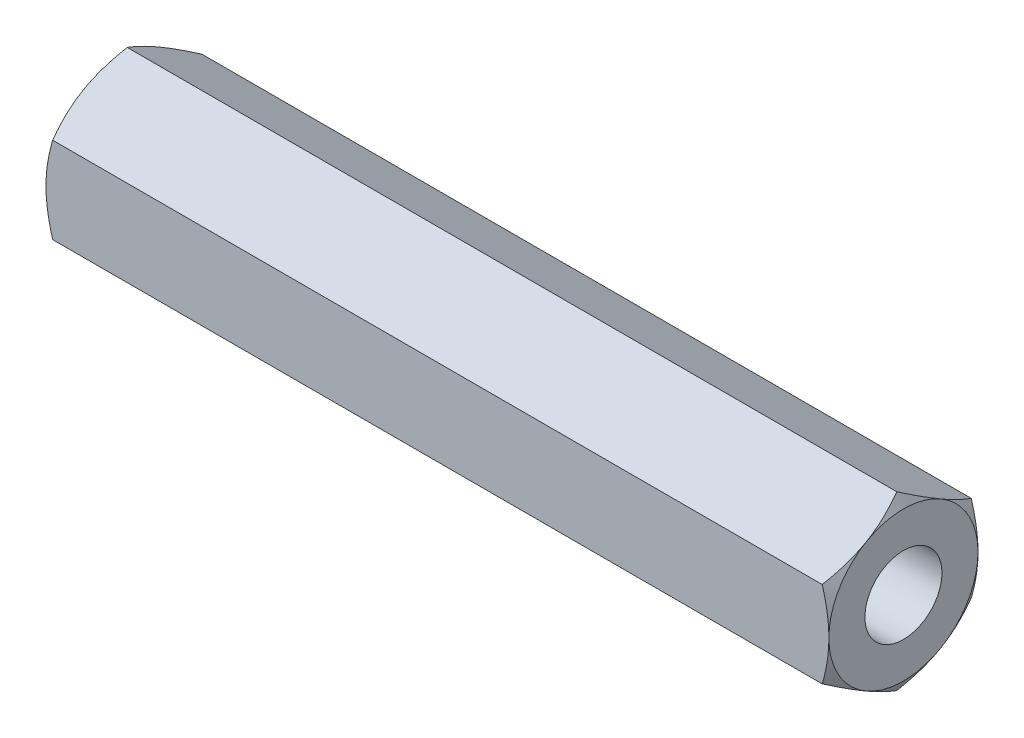
ISO-10303-21;
HEADER;
FILE_DESCRIPTION(('STEP AP214'),'2;1');
FILE_NAME('part.step','',(''),(''),'','','');
FILE_SCHEMA(('AUTOMOTIVE_DESIGN { 1 0 10303 214 1 1 1 1 }'));
ENDSEC;
DATA;
#1=APPLICATION_CONTEXT('core data for automotive mechanical design processes');
#2=APPLICATION_PROTOCOL_DEFINITION('international standard','automotive_design',2000,#1);
#3=PRODUCT_CONTEXT('',#1,'mechanical');
#4=PRODUCT('Part','Part','',(#3));
#5=PRODUCT_RELATED_PRODUCT_CATEGORY('part','',(#4));
#6=PRODUCT_DEFINITION_FORMATION('','',#4);
#7=PRODUCT_DEFINITION_CONTEXT('part definition',#1,'design');
#8=PRODUCT_DEFINITION('design','',#6,#7);
#9=PRODUCT_DEFINITION_SHAPE('','',#8);
#10=(LENGTH_UNIT() NAMED_UNIT(*) SI_UNIT(.MILLI.,.METRE.));
#11=(NAMED_UNIT(*) PLANE_ANGLE_UNIT() SI_UNIT($,.RADIAN.));
#12=(NAMED_UNIT(*) SI_UNIT($,.STERADIAN.) SOLID_ANGLE_UNIT());
#13=UNCERTAINTY_MEASURE_WITH_UNIT(LENGTH_MEASURE(1.E-05),#10,'distance_accuracy_value','');
#14=(GEOMETRIC_REPRESENTATION_CONTEXT(3) GLOBAL_UNCERTAINTY_ASSIGNED_CONTEXT((#13)) GLOBAL_UNIT_ASSIGNED_CONTEXT((#10,
#11,#12)) REPRESENTATION_CONTEXT('',''));
#15=CARTESIAN_POINT('',(0.,0.,0.));
#16=DIRECTION('',(0.,0.,1.));
#17=DIRECTION('',(1.,0.,0.));
#18=AXIS2_PLACEMENT_3D('',#15,#16,#17);
#19=CARTESIAN_POINT('',(42.,-2.3094010767585,4.));
#20=DIRECTION('',(0.,0.866025403784439,-0.5));
#21=DIRECTION('',(0.,0.5,0.866025403784439));
#22=AXIS2_PLACEMENT_3D('',#19,#20,#21);
#23=PLANE('',#22);
#24=CARTESIAN_POINT('',(41.6426677409252,-2.30928560670466,4.0002));
#25=CARTESIAN_POINT('',(41.7012821263517,-2.4107717464617,3.82442084967677));
#26=CARTESIAN_POINT('',(41.7545896785377,-2.51313390883499,3.64712438367362));
#27=CARTESIAN_POINT('',(41.8476383292536,-2.71963072479811,3.28946140682429));
#28=CARTESIAN_POINT('',(41.8873465109703,-2.82376904741904,3.10908854102985));
#29=CARTESIAN_POINT('',(41.9491577847197,-3.03075510011795,2.75057818129721));
#30=CARTESIAN_POINT('',(41.9716722684771,-3.13357098372492,2.57249584706486));
#31=CARTESIAN_POINT('',(41.9985493768534,-3.33968651028528,2.21549328283349));
#32=CARTESIAN_POINT('',(42.0029342585731,-3.44298540411434,2.0365743503559));
#33=CARTESIAN_POINT('',(41.99380992706,-3.63600352522932,1.70225715780327));
#34=CARTESIAN_POINT('',(41.982541046012,-3.72575165335065,1.54680884001293));
#35=CARTESIAN_POINT('',(41.9468260092018,-3.90466320392054,1.23692494436494));
#36=CARTESIAN_POINT('',(41.9223676542885,-3.99382600759478,1.08249043825587));
#37=CARTESIAN_POINT('',(41.8612239350807,-4.17310641015197,0.771967672225421));
#38=CARTESIAN_POINT('',(41.8242793963451,-4.26320131938131,0.615918711936898));
#39=CARTESIAN_POINT('',(41.740429927452,-4.4420474282755,0.306148164596161));
#40=CARTESIAN_POINT('',(41.6935446977873,-4.53080091904966,0.152422609226222));
#41=CARTESIAN_POINT('',(41.6426677409252,-4.61891762357084,-0.000199999999999203));
#42=B_SPLINE_CURVE_WITH_KNOTS('',3,(#24,#25,#26,#27,#28,#29,#30,#31,#32,#33,#34,#35,#36,#37,#38,
#39,#40,#41),.UNSPECIFIED.,.F.,.F.,(4,2,2,2,2,2,2,2,4),(0.,0.634047835695967,1.26961969224544,
1.88946157213122,2.50854226669297,3.04757825393386,3.58711366126904,4.13861653143764,
4.68903648037743),.UNSPECIFIED.);
#43=CARTESIAN_POINT('',(41.6427344100918,-2.3094010767585,4.));
#44=VERTEX_POINT('',#43);
#45=CARTESIAN_POINT('',(42.,-3.46410161513776,2.));
#46=VERTEX_POINT('',#45);
#47=EDGE_CURVE('E272',#44,#46,#42,.T.);
#48=ORIENTED_EDGE('',*,*,#47,.F.);
#49=DIRECTION('',(-1.,0.,0.));
#50=VECTOR('',#49,1.);
#51=CARTESIAN_POINT('',(42.,-2.3094010767585,4.));
#52=LINE('',#51,#50);
#53=CARTESIAN_POINT('',(0.357265589908165,-2.30940107675851,4.));
#54=VERTEX_POINT('',#53);
#55=EDGE_CURVE('E337',#44,#54,#52,.T.);
#56=ORIENTED_EDGE('',*,*,#55,.T.);
#57=CARTESIAN_POINT('',(0.357332259074767,-4.61891762357084,-0.000199999999999105));
#58=CARTESIAN_POINT('',(0.298717873648282,-4.5174314838138,0.175579150323229));
#59=CARTESIAN_POINT('',(0.245410321462262,-4.41506932144051,0.352875616326382));
#60=CARTESIAN_POINT('',(0.152361670746403,-4.20857250547739,0.710538593175708));
#61=CARTESIAN_POINT('',(0.112653489029703,-4.10443418285647,0.890911458970153));
#62=CARTESIAN_POINT('',(0.0508422152802779,-3.89744813015756,1.24942181870279));
#63=CARTESIAN_POINT('',(0.0283277315228877,-3.79463224655059,1.42750415293514));
#64=CARTESIAN_POINT('',(0.00145062314658058,-3.58851671999023,1.78450671716651));
#65=CARTESIAN_POINT('',(-0.0029342585730581,-3.48521782616117,1.9634256496441));
#66=CARTESIAN_POINT('',(0.00619007293996886,-3.29219970504619,2.29774284219673));
#67=CARTESIAN_POINT('',(0.0174589539879928,-3.20245157692486,2.45319115998707));
#68=CARTESIAN_POINT('',(0.053173990798192,-3.02354002635496,2.76307505563506));
#69=CARTESIAN_POINT('',(0.0776323457115323,-2.93437722268072,2.91750956174413));
#70=CARTESIAN_POINT('',(0.138776064919289,-2.75509682012354,3.22803232777458));
#71=CARTESIAN_POINT('',(0.175720603654863,-2.6650019108942,3.3840812880631));
#72=CARTESIAN_POINT('',(0.259570072548027,-2.486155802,3.69385183540384));
#73=CARTESIAN_POINT('',(0.30645530221274,-2.39740231122585,3.84757739077378));
#74=CARTESIAN_POINT('',(0.357332259074767,-2.30928560670466,4.0002));
#75=B_SPLINE_CURVE_WITH_KNOTS('',3,(#57,#58,#59,#60,#61,#62,#63,#64,#65,#66,#67,#68,#69,#70,#71,
#72,#73,#74),.UNSPECIFIED.,.F.,.F.,(4,2,2,2,2,2,2,2,4),(0.,0.634047835695967,1.26961969224544,
1.88946157213122,2.50854226669297,3.04757825393386,3.58711366126903,4.13861653143764,
4.68903648037743),.UNSPECIFIED.);
#76=CARTESIAN_POINT('',(0.,-3.46410161513776,2.));
#77=VERTEX_POINT('',#76);
#78=EDGE_CURVE('E220',#77,#54,#75,.T.);
#79=ORIENTED_EDGE('',*,*,#78,.F.);
#80=CARTESIAN_POINT('',(0.357265589908165,-4.61880215351701,0.));
#81=VERTEX_POINT('',#80);
#82=EDGE_CURVE('E335',#81,#77,#75,.T.);
#83=ORIENTED_EDGE('',*,*,#82,.F.);
#84=DIRECTION('',(-1.,0.,0.));
#85=VECTOR('',#84,1.);
#86=CARTESIAN_POINT('',(42.,-4.61880215351701,0.));
#87=LINE('',#86,#85);
#88=CARTESIAN_POINT('',(41.6427344100918,-4.61880215351701,0.));
#89=VERTEX_POINT('',#88);
#90=EDGE_CURVE('E298',#89,#81,#87,.T.);
#91=ORIENTED_EDGE('',*,*,#90,.F.);
#92=EDGE_CURVE('E267',#46,#89,#42,.T.);
#93=ORIENTED_EDGE('',*,*,#92,.F.);
#94=EDGE_LOOP('',(#48,#56,#79,#83,#91,#93));
#95=FACE_BOUND('',#94,.T.);
#96=ADVANCED_FACE('F41',(#95),#23,.F.);
#97=CARTESIAN_POINT('',(42.,-4.61880215351701,0.));
#98=DIRECTION('',(0.,0.866025403784439,0.5));
#99=DIRECTION('',(0.,-0.5,0.866025403784439));
#100=AXIS2_PLACEMENT_3D('',#97,#98,#99);
#101=PLANE('',#100);
#102=CARTESIAN_POINT('',(41.6426677409252,-4.61891762357084,0.00020000000000113));
#103=CARTESIAN_POINT('',(41.7012821263517,-4.5174314838138,-0.175579150323227));
#104=CARTESIAN_POINT('',(41.7545896785377,-4.41506932144052,-0.35287561632638));
#105=CARTESIAN_POINT('',(41.8476383292536,-4.20857250547739,-0.710538593175706));
#106=CARTESIAN_POINT('',(41.8873465109703,-4.10443418285647,-0.890911458970151));
#107=CARTESIAN_POINT('',(41.9491577847197,-3.89744813015756,-1.24942181870279));
#108=CARTESIAN_POINT('',(41.9716722684771,-3.79463224655059,-1.42750415293514));
#109=CARTESIAN_POINT('',(41.9985493768534,-3.58851671999023,-1.78450671716651));
#110=CARTESIAN_POINT('',(42.0029342585731,-3.48521782616117,-1.9634256496441));
#111=CARTESIAN_POINT('',(41.99380992706,-3.29219970504619,-2.29774284219673));
#112=CARTESIAN_POINT('',(41.982541046012,-3.20245157692486,-2.45319115998707));
#113=CARTESIAN_POINT('',(41.9468260092018,-3.02354002635497,-2.76307505563506));
#114=CARTESIAN_POINT('',(41.9223676542885,-2.93437722268072,-2.91750956174413));
#115=CARTESIAN_POINT('',(41.8612239350807,-2.75509682012354,-3.22803232777458));
#116=CARTESIAN_POINT('',(41.8242793963451,-2.6650019108942,-3.3840812880631));
#117=CARTESIAN_POINT('',(41.740429927452,-2.48615580200001,-3.69385183540384));
#118=CARTESIAN_POINT('',(41.6935446977873,-2.39740231122585,-3.84757739077378));
#119=CARTESIAN_POINT('',(41.6426677409252,-2.30928560670467,-4.0002));
#120=B_SPLINE_CURVE_WITH_KNOTS('',3,(#102,#103,#104,#105,#106,#107,#108,#109,#110,#111,#112,
#113,#114,#115,#116,#117,#118,#119),.UNSPECIFIED.,.F.,.F.,(4,2,2,2,2,2,2,2,4),(0.,
0.634047835695966,1.26961969224544,1.88946157213122,2.50854226669298,3.04757825393386,
3.58711366126903,4.13861653143764,4.68903648037743),.UNSPECIFIED.);
#121=CARTESIAN_POINT('',(42.,-3.46410161513776,-2.));
#122=VERTEX_POINT('',#121);
#123=EDGE_CURVE('E260',#89,#122,#120,.T.);
#124=ORIENTED_EDGE('',*,*,#123,.F.);
#125=ORIENTED_EDGE('',*,*,#90,.T.);
#126=CARTESIAN_POINT('',(0.357332259074767,-2.30928560670467,-4.0002));
#127=CARTESIAN_POINT('',(0.298717873648282,-2.41077174646171,-3.82442084967677));
#128=CARTESIAN_POINT('',(0.245410321462262,-2.513133908835,-3.64712438367362));
#129=CARTESIAN_POINT('',(0.152361670746403,-2.71963072479812,-3.28946140682429));
#130=CARTESIAN_POINT('',(0.112653489029703,-2.82376904741904,-3.10908854102985));
#131=CARTESIAN_POINT('',(0.0508422152802779,-3.03075510011795,-2.75057818129721));
#132=CARTESIAN_POINT('',(0.0283277315228874,-3.13357098372492,-2.57249584706485));
#133=CARTESIAN_POINT('',(0.00145062314658054,-3.33968651028528,-2.21549328283349));
#134=CARTESIAN_POINT('',(-0.00293425857305766,-3.44298540411434,-2.0365743503559));
#135=CARTESIAN_POINT('',(0.00619007293996941,-3.63600352522932,-1.70225715780326));
#136=CARTESIAN_POINT('',(0.0174589539879931,-3.72575165335065,-1.54680884001293));
#137=CARTESIAN_POINT('',(0.0531739907981921,-3.90466320392054,-1.23692494436494));
#138=CARTESIAN_POINT('',(0.0776323457115324,-3.99382600759478,-1.08249043825587));
#139=CARTESIAN_POINT('',(0.138776064919289,-4.17310641015197,-0.77196767222542));
#140=CARTESIAN_POINT('',(0.175720603654863,-4.26320131938131,-0.615918711936896));
#141=CARTESIAN_POINT('',(0.259570072548027,-4.4420474282755,-0.306148164596159));
#142=CARTESIAN_POINT('',(0.30645530221274,-4.53080091904966,-0.15242260922622));
#143=CARTESIAN_POINT('',(0.357332259074767,-4.61891762357084,0.000200000000000806));
#144=B_SPLINE_CURVE_WITH_KNOTS('',3,(#126,#127,#128,#129,#130,#131,#132,#133,#134,#135,#136,
#137,#138,#139,#140,#141,#142,#143),.UNSPECIFIED.,.F.,.F.,(4,2,2,2,2,2,2,2,4),(0.,
0.634047835695967,1.26961969224543,1.88946157213122,2.50854226669297,3.04757825393386,
3.58711366126903,4.13861653143764,4.68903648037743),.UNSPECIFIED.);
#145=CARTESIAN_POINT('',(0.,-3.46410161513776,-2.));
#146=VERTEX_POINT('',#145);
#147=EDGE_CURVE('E232',#146,#81,#144,.T.);
#148=ORIENTED_EDGE('',*,*,#147,.F.);
#149=CARTESIAN_POINT('',(0.357265589908165,-2.30940107675851,-4.));
#150=VERTEX_POINT('',#149);
#151=EDGE_CURVE('E238',#150,#146,#144,.T.);
#152=ORIENTED_EDGE('',*,*,#151,.F.);
#153=DIRECTION('',(-1.,0.,0.));
#154=VECTOR('',#153,1.);
#155=CARTESIAN_POINT('',(42.,-2.3094010767585,-4.));
#156=LINE('',#155,#154);
#157=CARTESIAN_POINT('',(41.6427344100918,-2.30940107675851,-4.));
#158=VERTEX_POINT('',#157);
#159=EDGE_CURVE('E292',#158,#150,#156,.T.);
#160=ORIENTED_EDGE('',*,*,#159,.F.);
#161=EDGE_CURVE('E254',#122,#158,#120,.T.);
#162=ORIENTED_EDGE('',*,*,#161,.F.);
#163=EDGE_LOOP('',(#124,#125,#148,#152,#160,#162));
#164=FACE_BOUND('',#163,.T.);
#165=ADVANCED_FACE('F246',(#164),#101,.F.);
#166=CARTESIAN_POINT('',(42.,-2.3094010767585,-4.));
#167=DIRECTION('',(0.,0.,1.));
#168=DIRECTION('',(1.,0.,0.));
#169=AXIS2_PLACEMENT_3D('',#166,#167,#168);
#170=PLANE('',#169);
#171=CARTESIAN_POINT('',(40.0858931787593,-6.12487198995892,-4.));
#172=CARTESIAN_POINT('',(40.1707637292331,-5.94924937038676,-4.));
#173=CARTESIAN_POINT('',(40.2547905961926,-5.77321152095286,-4.));
#174=CARTESIAN_POINT('',(40.4206748532028,-5.42008084777954,-4.));
#175=CARTESIAN_POINT('',(40.5025318676328,-5.24298784779927,-4.));
#176=CARTESIAN_POINT('',(40.6640255369414,-4.88656571686334,-4.));
#177=CARTESIAN_POINT('',(40.743646804937,-4.70722958889362,-4.));
#178=CARTESIAN_POINT('',(40.8994694145797,-4.34708334747263,-4.));
#179=CARTESIAN_POINT('',(40.975670934492,-4.16627331143537,-4.));
#180=CARTESIAN_POINT('',(41.1246493496056,-3.80064706744977,-4.));
#181=CARTESIAN_POINT('',(41.1973727157842,-3.6158089282277,-4.));
#182=CARTESIAN_POINT('',(41.3371237690406,-3.24395246794968,-4.));
#183=CARTESIAN_POINT('',(41.4041508224335,-3.05693390695801,-4.));
#184=CARTESIAN_POINT('',(41.5307082515691,-2.6808031825377,-4.));
#185=CARTESIAN_POINT('',(41.5902545652162,-2.49169643712848,-4.));
#186=CARTESIAN_POINT('',(41.6999166434555,-2.11079454635851,-4.));
#187=CARTESIAN_POINT('',(41.7500353903232,-1.91900027185749,-4.));
#188=CARTESIAN_POINT('',(41.838409205046,-1.532592326982,-4.));
#189=CARTESIAN_POINT('',(41.8766611140435,-1.33797792031649,-4.));
#190=CARTESIAN_POINT('',(41.9387257640777,-0.946402725872552,-4.));
#191=CARTESIAN_POINT('',(41.9625384923483,-0.749441936019772,-4.));
#192=CARTESIAN_POINT('',(41.9936181868506,-0.35545198962794,-4.));
#193=CARTESIAN_POINT('',(42.000989900761,-0.158431311094008,-4.));
#194=CARTESIAN_POINT('',(41.9987959336252,0.235472085607472,-4.));
#195=CARTESIAN_POINT('',(41.9892346491847,0.432354826312209,-4.));
#196=CARTESIAN_POINT('',(41.9591212653864,0.76856063522552,-4.));
#197=CARTESIAN_POINT('',(41.9424907039561,0.908254618381822,-4.));
#198=CARTESIAN_POINT('',(41.9017865896533,1.18656349063497,-4.));
#199=CARTESIAN_POINT('',(41.8777118629416,1.32517820601013,-4.));
#200=CARTESIAN_POINT('',(41.7955849290498,1.73929045452969,-4.));
#201=CARTESIAN_POINT('',(41.7276511135749,2.01284690528722,-4.));
#202=CARTESIAN_POINT('',(41.6104836406828,2.42218253014524,-4.));
#203=CARTESIAN_POINT('',(41.5682860581884,2.56009536361538,-4.));
#204=CARTESIAN_POINT('',(41.4797154197722,2.83448159101403,-4.));
#205=CARTESIAN_POINT('',(41.4333452438131,2.97095590623557,-4.));
#206=CARTESIAN_POINT('',(41.3373943008197,3.2418944051634,-4.));
#207=CARTESIAN_POINT('',(41.2878330742465,3.37636557946838,-4.));
#208=CARTESIAN_POINT('',(41.1858016462093,3.64426461152913,-4.));
#209=CARTESIAN_POINT('',(41.1333302690366,3.77769202239386,-4.));
#210=CARTESIAN_POINT('',(41.0796909934582,3.91063698986683,-4.));
#211=B_SPLINE_CURVE_WITH_KNOTS('',3,(#171,#172,#173,#174,#175,#176,#177,#178,#179,#180,#181,
#182,#183,#184,#185,#186,#187,#188,#189,#190,#191,#192,#193,#194,#195,#196,#197,#198,#199,#200,
#201,#202,#203,#204,#205,#206,#207,#208,#209,#210),.UNSPECIFIED.,.F.,.F.,(4,2,2,2,2,2,2,2,2,2,2,
2,2,2,2,2,2,2,2,4),(0.,0.585171792532272,1.17044423059927,1.7590659464599,2.34765694284827,
2.94347400997484,3.53935727210689,4.13394864697601,4.72835161391471,5.32291267067845,
5.91747425310813,6.50823685854037,7.09884609659887,7.52068140825521,7.9425832713084,
8.78701491359829,9.21965281897689,9.65199437116297,10.0819024146297,10.5119854255247),.UNSPECIFIED.);
#212=CARTESIAN_POINT('',(42.,0.,-4.));
#213=VERTEX_POINT('',#212);
#214=EDGE_CURVE('E261',#158,#213,#211,.T.);
#215=ORIENTED_EDGE('',*,*,#214,.F.);
#216=ORIENTED_EDGE('',*,*,#159,.T.);
#217=CARTESIAN_POINT('',(1.91410682124063,-6.12487198995892,-4.));
#218=CARTESIAN_POINT('',(1.82923627076689,-5.94924937038676,-4.));
#219=CARTESIAN_POINT('',(1.74520940380739,-5.77321152095286,-4.));
#220=CARTESIAN_POINT('',(1.57932514679716,-5.42008084777954,-4.));
#221=CARTESIAN_POINT('',(1.49746813236723,-5.24298784779927,-4.));
#222=CARTESIAN_POINT('',(1.33597446305855,-4.88656571686333,-4.));
#223=CARTESIAN_POINT('',(1.25635319506303,-4.70722958889362,-4.));
#224=CARTESIAN_POINT('',(1.10053058542029,-4.34708334747263,-4.));
#225=CARTESIAN_POINT('',(1.02432906550802,-4.16627331143537,-4.));
#226=CARTESIAN_POINT('',(0.875350650394359,-3.80064706744977,-4.));
#227=CARTESIAN_POINT('',(0.802627284215842,-3.61580892822769,-4.));
#228=CARTESIAN_POINT('',(0.662876230959417,-3.24395246794968,-4.));
#229=CARTESIAN_POINT('',(0.595849177566501,-3.05693390695801,-4.));
#230=CARTESIAN_POINT('',(0.469291748430878,-2.6808031825377,-4.));
#231=CARTESIAN_POINT('',(0.409745434783834,-2.49169643712848,-4.));
#232=CARTESIAN_POINT('',(0.300083356544504,-2.11079454635851,-4.));
#233=CARTESIAN_POINT('',(0.249964609676749,-1.91900027185748,-4.));
#234=CARTESIAN_POINT('',(0.16159079495404,-1.532592326982,-4.));
#235=CARTESIAN_POINT('',(0.123338885956538,-1.33797792031649,-4.));
#236=CARTESIAN_POINT('',(0.0612742359223416,-0.946402725872551,-4.));
#237=CARTESIAN_POINT('',(0.0374615076516972,-0.749441936019771,-4.));
#238=CARTESIAN_POINT('',(0.00638181314943468,-0.35545198962794,-4.));
#239=CARTESIAN_POINT('',(-0.000989900761042906,-0.158431311094009,-4.));
#240=CARTESIAN_POINT('',(0.00120406637479443,0.23547208560747,-4.));
#241=CARTESIAN_POINT('',(0.0107653508153499,0.432354826312207,-4.));
#242=CARTESIAN_POINT('',(0.0408787346135898,0.768560635225518,-4.));
#243=CARTESIAN_POINT('',(0.0575092960439087,0.908254618381821,-4.));
#244=CARTESIAN_POINT('',(0.0982134103466909,1.18656349063497,-4.));
#245=CARTESIAN_POINT('',(0.122288137058446,1.32517820601013,-4.));
#246=CARTESIAN_POINT('',(0.204415070950231,1.7392904545297,-4.));
#247=CARTESIAN_POINT('',(0.272348886425153,2.01284690528723,-4.));
#248=CARTESIAN_POINT('',(0.389516359317204,2.42218253014524,-4.));
#249=CARTESIAN_POINT('',(0.431713941811637,2.56009536361539,-4.));
#250=CARTESIAN_POINT('',(0.520284580227763,2.83448159101404,-4.));
#251=CARTESIAN_POINT('',(0.566654756186913,2.97095590623558,-4.));
#252=CARTESIAN_POINT('',(0.662605699180287,3.24189440516341,-4.));
#253=CARTESIAN_POINT('',(0.712166925753501,3.37636557946839,-4.));
#254=CARTESIAN_POINT('',(0.814198353790704,3.64426461152915,-4.));
#255=CARTESIAN_POINT('',(0.866669730963372,3.77769202239388,-4.));
#256=CARTESIAN_POINT('',(0.920309006541795,3.91063698986685,-4.));
#257=B_SPLINE_CURVE_WITH_KNOTS('',3,(#217,#218,#219,#220,#221,#222,#223,#224,#225,#226,#227,
#228,#229,#230,#231,#232,#233,#234,#235,#236,#237,#238,#239,#240,#241,#242,#243,#244,#245,#246,
#247,#248,#249,#250,#251,#252,#253,#254,#255,#256),.UNSPECIFIED.,.F.,.F.,(4,2,2,2,2,2,2,2,2,2,2,
2,2,2,2,2,2,2,2,4),(0.,0.58517179253227,1.17044423059927,1.7590659464599,2.34765694284827,
2.94347400997483,3.53935727210689,4.133948646976,4.72835161391471,5.32291267067845,
5.91747425310812,6.50823685854036,7.09884609659886,7.52068140825521,7.94258327130839,
8.7870149135983,9.21965281897689,9.65199437116297,10.0819024146297,10.5119854255247),.UNSPECIFIED.);
#258=CARTESIAN_POINT('',(0.,0.,-4.));
#259=VERTEX_POINT('',#258);
#260=EDGE_CURVE('E239',#259,#150,#257,.F.);
#261=ORIENTED_EDGE('',*,*,#260,.F.);
#262=CARTESIAN_POINT('',(0.357265589908165,2.3094010767585,-4.));
#263=VERTEX_POINT('',#262);
#264=EDGE_CURVE('E346',#263,#259,#257,.F.);
#265=ORIENTED_EDGE('',*,*,#264,.F.);
#266=DIRECTION('',(-1.,0.,0.));
#267=VECTOR('',#266,1.);
#268=CARTESIAN_POINT('',(42.,2.30940107675851,-4.));
#269=LINE('',#268,#267);
#270=CARTESIAN_POINT('',(41.6427344100918,2.30940107675851,-4.));
#271=VERTEX_POINT('',#270);
#272=EDGE_CURVE('E299',#271,#263,#269,.T.);
#273=ORIENTED_EDGE('',*,*,#272,.F.);
#274=EDGE_CURVE('E262',#213,#271,#211,.T.);
#275=ORIENTED_EDGE('',*,*,#274,.F.);
#276=EDGE_LOOP('',(#215,#216,#261,#265,#273,#275));
#277=FACE_BOUND('',#276,.T.);
#278=ADVANCED_FACE('F249',(#277),#170,.F.);
#279=CARTESIAN_POINT('',(42.,2.30940107675851,-4.));
#280=DIRECTION('',(0.,-0.866025403784438,0.5));
#281=DIRECTION('',(0.,-0.5,-0.866025403784439));
#282=AXIS2_PLACEMENT_3D('',#279,#280,#281);
#283=PLANE('',#282);
#284=CARTESIAN_POINT('',(41.6426677409252,2.30928560670467,-4.0002));
#285=CARTESIAN_POINT('',(41.7012821263517,2.41077174646171,-3.82442084967677));
#286=CARTESIAN_POINT('',(41.7545896785377,2.513133908835,-3.64712438367362));
#287=CARTESIAN_POINT('',(41.8476383292536,2.71963072479812,-3.28946140682429));
#288=CARTESIAN_POINT('',(41.8873465109703,2.82376904741905,-3.10908854102985));
#289=CARTESIAN_POINT('',(41.9491577847197,3.03075510011795,-2.75057818129721));
#290=CARTESIAN_POINT('',(41.9716722684771,3.13357098372492,-2.57249584706485));
#291=CARTESIAN_POINT('',(41.9985493768534,3.33968651028529,-2.21549328283349));
#292=CARTESIAN_POINT('',(42.0029342585731,3.44298540411434,-2.0365743503559));
#293=CARTESIAN_POINT('',(41.99380992706,3.63600352522933,-1.70225715780326));
#294=CARTESIAN_POINT('',(41.982541046012,3.72575165335065,-1.54680884001293));
#295=CARTESIAN_POINT('',(41.9468260092018,3.90466320392055,-1.23692494436494));
#296=CARTESIAN_POINT('',(41.9223676542885,3.99382600759479,-1.08249043825587));
#297=CARTESIAN_POINT('',(41.8612239350807,4.17310641015197,-0.771967672225422));
#298=CARTESIAN_POINT('',(41.8242793963451,4.26320131938131,-0.615918711936898));
#299=CARTESIAN_POINT('',(41.740429927452,4.4420474282755,-0.306148164596161));
#300=CARTESIAN_POINT('',(41.6935446977873,4.53080091904966,-0.152422609226221));
#301=CARTESIAN_POINT('',(41.6426677409252,4.61891762357085,0.00019999999999897));
#302=B_SPLINE_CURVE_WITH_KNOTS('',3,(#284,#285,#286,#287,#288,#289,#290,#291,#292,#293,#294,
#295,#296,#297,#298,#299,#300,#301),.UNSPECIFIED.,.F.,.F.,(4,2,2,2,2,2,2,2,4),(0.,
0.634047835695966,1.26961969224544,1.88946157213122,2.50854226669297,3.04757825393386,
3.58711366126903,4.13861653143764,4.68903648037743),.UNSPECIFIED.);
#303=CARTESIAN_POINT('',(42.,3.46410161513776,-2.));
#304=VERTEX_POINT('',#303);
#305=EDGE_CURVE('E360',#271,#304,#302,.T.);
#306=ORIENTED_EDGE('',*,*,#305,.F.);
#307=ORIENTED_EDGE('',*,*,#272,.T.);
#308=CARTESIAN_POINT('',(0.357332259074769,4.61891762357085,0.000199999999999029));
#309=CARTESIAN_POINT('',(0.298717873648285,4.51743148381381,-0.175579150323229));
#310=CARTESIAN_POINT('',(0.245410321462264,4.41506932144052,-0.352875616326382));
#311=CARTESIAN_POINT('',(0.152361670746404,4.2085725054774,-0.710538593175708));
#312=CARTESIAN_POINT('',(0.112653489029704,4.10443418285647,-0.890911458970153));
#313=CARTESIAN_POINT('',(0.0508422152802789,3.89744813015756,-1.24942181870279));
#314=CARTESIAN_POINT('',(0.0283277315228891,3.79463224655059,-1.42750415293515));
#315=CARTESIAN_POINT('',(0.00145062314658209,3.58851671999023,-1.78450671716651));
#316=CARTESIAN_POINT('',(-0.00293425857305701,3.48521782616117,-1.9634256496441));
#317=CARTESIAN_POINT('',(0.00619007293997012,3.29219970504619,-2.29774284219674));
#318=CARTESIAN_POINT('',(0.0174589539879945,3.20245157692486,-2.45319115998707));
#319=CARTESIAN_POINT('',(0.0531739907981938,3.02354002635497,-2.76307505563506));
#320=CARTESIAN_POINT('',(0.0776323457115336,2.93437722268073,-2.91750956174413));
#321=CARTESIAN_POINT('',(0.13877606491929,2.75509682012354,-3.22803232777458));
#322=CARTESIAN_POINT('',(0.175720603654864,2.6650019108942,-3.3840812880631));
#323=CARTESIAN_POINT('',(0.259570072548028,2.48615580200001,-3.69385183540384));
#324=CARTESIAN_POINT('',(0.306455302212741,2.39740231122585,-3.84757739077378));
#325=CARTESIAN_POINT('',(0.357332259074767,2.30928560670467,-4.0002));
#326=B_SPLINE_CURVE_WITH_KNOTS('',3,(#308,#309,#310,#311,#312,#313,#314,#315,#316,#317,#318,
#319,#320,#321,#322,#323,#324,#325),.UNSPECIFIED.,.F.,.F.,(4,2,2,2,2,2,2,2,4),(0.,
0.634047835695967,1.26961969224544,1.88946157213122,2.50854226669297,3.04757825393386,
3.58711366126903,4.13861653143764,4.68903648037743),.UNSPECIFIED.);
#327=CARTESIAN_POINT('',(0.,3.46410161513776,-2.));
#328=VERTEX_POINT('',#327);
#329=EDGE_CURVE('E343',#328,#263,#326,.T.);
#330=ORIENTED_EDGE('',*,*,#329,.F.);
#331=CARTESIAN_POINT('',(0.357265589908165,4.61880215351701,0.));
#332=VERTEX_POINT('',#331);
#333=EDGE_CURVE('E226',#332,#328,#326,.T.);
#334=ORIENTED_EDGE('',*,*,#333,.F.);
#335=DIRECTION('',(-1.,0.,0.));
#336=VECTOR('',#335,1.);
#337=CARTESIAN_POINT('',(42.,4.61880215351701,0.));
#338=LINE('',#337,#336);
#339=CARTESIAN_POINT('',(41.6427344100918,4.61880215351701,0.));
#340=VERTEX_POINT('',#339);
#341=EDGE_CURVE('E303',#340,#332,#338,.T.);
#342=ORIENTED_EDGE('',*,*,#341,.F.);
#343=EDGE_CURVE('E359',#304,#340,#302,.T.);
#344=ORIENTED_EDGE('',*,*,#343,.F.);
#345=EDGE_LOOP('',(#306,#307,#330,#334,#342,#344));
#346=FACE_BOUND('',#345,.T.);
#347=ADVANCED_FACE('F358',(#346),#283,.F.);
#348=CARTESIAN_POINT('',(42.,4.61880215351701,0.));
#349=DIRECTION('',(0.,-0.866025403784439,-0.5));
#350=DIRECTION('',(0.,0.5,-0.866025403784439));
#351=AXIS2_PLACEMENT_3D('',#348,#349,#350);
#352=PLANE('',#351);
#353=CARTESIAN_POINT('',(41.6426677409252,4.61891762357085,-0.000200000000000971));
#354=CARTESIAN_POINT('',(41.7012821263517,4.51743148381381,0.175579150323227));
#355=CARTESIAN_POINT('',(41.7545896785377,4.41506932144052,0.352875616326379));
#356=CARTESIAN_POINT('',(41.8476383292536,4.2085725054774,0.710538593175705));
#357=CARTESIAN_POINT('',(41.8873465109703,4.10443418285647,0.89091145897015));
#358=CARTESIAN_POINT('',(41.9491577847197,3.89744813015756,1.24942181870279));
#359=CARTESIAN_POINT('',(41.9716722684771,3.79463224655059,1.42750415293514));
#360=CARTESIAN_POINT('',(41.9985493768534,3.58851671999023,1.78450671716651));
#361=CARTESIAN_POINT('',(42.0029342585731,3.48521782616117,1.9634256496441));
#362=CARTESIAN_POINT('',(41.99380992706,3.29219970504619,2.29774284219673));
#363=CARTESIAN_POINT('',(41.982541046012,3.20245157692486,2.45319115998707));
#364=CARTESIAN_POINT('',(41.9468260092018,3.02354002635497,2.76307505563506));
#365=CARTESIAN_POINT('',(41.9223676542885,2.93437722268073,2.91750956174413));
#366=CARTESIAN_POINT('',(41.8612239350807,2.75509682012354,3.22803232777458));
#367=CARTESIAN_POINT('',(41.8242793963451,2.6650019108942,3.3840812880631));
#368=CARTESIAN_POINT('',(41.740429927452,2.48615580200001,3.69385183540384));
#369=CARTESIAN_POINT('',(41.6935446977873,2.39740231122585,3.84757739077378));
#370=CARTESIAN_POINT('',(41.6426677409252,2.30928560670467,4.0002));
#371=B_SPLINE_CURVE_WITH_KNOTS('',3,(#353,#354,#355,#356,#357,#358,#359,#360,#361,#362,#363,
#364,#365,#366,#367,#368,#369,#370),.UNSPECIFIED.,.F.,.F.,(4,2,2,2,2,2,2,2,4),(0.,
0.634047835695965,1.26961969224544,1.88946157213122,2.50854226669297,3.04757825393386,
3.58711366126904,4.13861653143764,4.68903648037743),.UNSPECIFIED.);
#372=CARTESIAN_POINT('',(42.,3.46410161513776,2.));
#373=VERTEX_POINT('',#372);
#374=EDGE_CURVE('E354',#340,#373,#371,.T.);
#375=ORIENTED_EDGE('',*,*,#374,.F.);
#376=ORIENTED_EDGE('',*,*,#341,.T.);
#377=CARTESIAN_POINT('',(0.357332259074768,2.30928560670467,4.0002));
#378=CARTESIAN_POINT('',(0.298717873648284,2.41077174646171,3.82442084967677));
#379=CARTESIAN_POINT('',(0.245410321462264,2.513133908835,3.64712438367362));
#380=CARTESIAN_POINT('',(0.152361670746404,2.71963072479812,3.28946140682429));
#381=CARTESIAN_POINT('',(0.112653489029704,2.82376904741904,3.10908854102985));
#382=CARTESIAN_POINT('',(0.0508422152802789,3.03075510011795,2.75057818129721));
#383=CARTESIAN_POINT('',(0.0283277315228887,3.13357098372492,2.57249584706486));
#384=CARTESIAN_POINT('',(0.00145062314658153,3.33968651028529,2.21549328283349));
#385=CARTESIAN_POINT('',(-0.00293425857305726,3.44298540411434,2.0365743503559));
#386=CARTESIAN_POINT('',(0.00619007293997,3.63600352522933,1.70225715780327));
#387=CARTESIAN_POINT('',(0.0174589539879943,3.72575165335065,1.54680884001293));
#388=CARTESIAN_POINT('',(0.0531739907981936,3.90466320392055,1.23692494436494));
#389=CARTESIAN_POINT('',(0.0776323457115335,3.99382600759479,1.08249043825587));
#390=CARTESIAN_POINT('',(0.13877606491929,4.17310641015197,0.771967672225421));
#391=CARTESIAN_POINT('',(0.175720603654864,4.26320131938131,0.615918711936897));
#392=CARTESIAN_POINT('',(0.259570072548028,4.44204742827551,0.30614816459616));
#393=CARTESIAN_POINT('',(0.306455302212742,4.53080091904966,0.15242260922622));
#394=CARTESIAN_POINT('',(0.357332259074769,4.61891762357085,-0.00020000000000084));
#395=B_SPLINE_CURVE_WITH_KNOTS('',3,(#377,#378,#379,#380,#381,#382,#383,#384,#385,#386,#387,
#388,#389,#390,#391,#392,#393,#394),.UNSPECIFIED.,.F.,.F.,(4,2,2,2,2,2,2,2,4),(0.,
0.634047835695967,1.26961969224544,1.88946157213122,2.50854226669297,3.04757825393386,
3.58711366126904,4.13861653143764,4.68903648037743),.UNSPECIFIED.);
#396=CARTESIAN_POINT('',(0.,3.46410161513776,2.));
#397=VERTEX_POINT('',#396);
#398=EDGE_CURVE('E338',#397,#332,#395,.T.);
#399=ORIENTED_EDGE('',*,*,#398,.F.);
#400=CARTESIAN_POINT('',(0.357265589908165,2.30940107675851,4.));
#401=VERTEX_POINT('',#400);
#402=EDGE_CURVE('E201',#401,#397,#395,.T.);
#403=ORIENTED_EDGE('',*,*,#402,.F.);
#404=DIRECTION('',(-1.,0.,0.));
#405=VECTOR('',#404,1.);
#406=CARTESIAN_POINT('',(42.,2.3094010767585,4.));
#407=LINE('',#406,#405);
#408=CARTESIAN_POINT('',(41.6427344100918,2.3094010767585,4.));
#409=VERTEX_POINT('',#408);
#410=EDGE_CURVE('E348',#409,#401,#407,.T.);
#411=ORIENTED_EDGE('',*,*,#410,.F.);
#412=EDGE_CURVE('E166',#373,#409,#371,.T.);
#413=ORIENTED_EDGE('',*,*,#412,.F.);
#414=EDGE_LOOP('',(#375,#376,#399,#403,#411,#413));
#415=FACE_BOUND('',#414,.T.);
#416=ADVANCED_FACE('F182',(#415),#352,.F.);
#417=CARTESIAN_POINT('',(42.,2.3094010767585,4.));
#418=DIRECTION('',(0.,0.,-1.));
#419=DIRECTION('',(-1.,0.,0.));
#420=AXIS2_PLACEMENT_3D('',#417,#418,#419);
#421=PLANE('',#420);
#422=CARTESIAN_POINT('',(40.0858931787593,-6.12487198995891,4.));
#423=CARTESIAN_POINT('',(40.1707637292331,-5.94924937038676,4.));
#424=CARTESIAN_POINT('',(40.2547905961926,-5.77321152095285,4.));
#425=CARTESIAN_POINT('',(40.4206748532028,-5.42008084777954,4.));
#426=CARTESIAN_POINT('',(40.5025318676328,-5.24298784779927,4.));
#427=CARTESIAN_POINT('',(40.6640255369414,-4.88656571686333,4.));
#428=CARTESIAN_POINT('',(40.743646804937,-4.70722958889362,4.));
#429=CARTESIAN_POINT('',(40.8994694145797,-4.34708334747263,4.));
#430=CARTESIAN_POINT('',(40.975670934492,-4.16627331143537,4.));
#431=CARTESIAN_POINT('',(41.1246493496056,-3.80064706744977,4.));
#432=CARTESIAN_POINT('',(41.1973727157842,-3.6158089282277,4.));
#433=CARTESIAN_POINT('',(41.3371237690406,-3.24395246794968,4.));
#434=CARTESIAN_POINT('',(41.4041508224335,-3.05693390695801,4.));
#435=CARTESIAN_POINT('',(41.5307082515691,-2.6808031825377,4.));
#436=CARTESIAN_POINT('',(41.5902545652162,-2.49169643712848,4.));
#437=CARTESIAN_POINT('',(41.6999166434555,-2.11079454635851,4.));
#438=CARTESIAN_POINT('',(41.7500353903232,-1.91900027185748,4.));
#439=CARTESIAN_POINT('',(41.838409205046,-1.53259232698199,4.));
#440=CARTESIAN_POINT('',(41.8766611140435,-1.33797792031649,4.));
#441=CARTESIAN_POINT('',(41.9387257640777,-0.946402725872545,4.));
#442=CARTESIAN_POINT('',(41.9625384923483,-0.749441936019766,4.));
#443=CARTESIAN_POINT('',(41.9936181868506,-0.355451989627935,4.));
#444=CARTESIAN_POINT('',(42.000989900761,-0.158431311094003,4.));
#445=CARTESIAN_POINT('',(41.9987959336252,0.235472085607476,4.));
#446=CARTESIAN_POINT('',(41.9892346491847,0.432354826312212,4.));
#447=CARTESIAN_POINT('',(41.9591212653864,0.768560635225523,4.));
#448=CARTESIAN_POINT('',(41.9424907039561,0.908254618381826,4.));
#449=CARTESIAN_POINT('',(41.9017865896533,1.18656349063498,4.));
#450=CARTESIAN_POINT('',(41.8777118629416,1.32517820601014,4.));
#451=CARTESIAN_POINT('',(41.7955849290498,1.73929045452969,4.));
#452=CARTESIAN_POINT('',(41.7276511135749,2.01284690528722,4.));
#453=CARTESIAN_POINT('',(41.6104836406828,2.42218253014523,4.));
#454=CARTESIAN_POINT('',(41.5682860581884,2.56009536361538,4.));
#455=CARTESIAN_POINT('',(41.4797154197722,2.83448159101403,4.));
#456=CARTESIAN_POINT('',(41.4333452438131,2.97095590623557,4.));
#457=CARTESIAN_POINT('',(41.3373943008197,3.2418944051634,4.));
#458=CARTESIAN_POINT('',(41.2878330742465,3.37636557946838,4.));
#459=CARTESIAN_POINT('',(41.1858016462093,3.64426461152913,4.));
#460=CARTESIAN_POINT('',(41.1333302690366,3.77769202239387,4.));
#461=CARTESIAN_POINT('',(41.0796909934582,3.91063698986684,4.));
#462=B_SPLINE_CURVE_WITH_KNOTS('',3,(#422,#423,#424,#425,#426,#427,#428,#429,#430,#431,#432,
#433,#434,#435,#436,#437,#438,#439,#440,#441,#442,#443,#444,#445,#446,#447,#448,#449,#450,#451,
#452,#453,#454,#455,#456,#457,#458,#459,#460,#461),.UNSPECIFIED.,.F.,.F.,(4,2,2,2,2,2,2,2,2,2,2,
2,2,2,2,2,2,2,2,4),(0.,0.585171792532269,1.17044423059927,1.7590659464599,2.34765694284827,
2.94347400997483,3.53935727210689,4.13394864697601,4.72835161391471,5.32291267067846,
5.91747425310813,6.50823685854037,7.09884609659887,7.52068140825522,7.9425832713084,
8.78701491359829,9.21965281897689,9.65199437116297,10.0819024146297,10.5119854255247),.UNSPECIFIED.);
#463=CARTESIAN_POINT('',(42.,0.,4.));
#464=VERTEX_POINT('',#463);
#465=EDGE_CURVE('E165',#409,#464,#462,.F.);
#466=ORIENTED_EDGE('',*,*,#465,.F.);
#467=ORIENTED_EDGE('',*,*,#410,.T.);
#468=CARTESIAN_POINT('',(1.91410682124064,-6.12487198995891,4.));
#469=CARTESIAN_POINT('',(1.82923627076689,-5.94924937038676,4.));
#470=CARTESIAN_POINT('',(1.74520940380739,-5.77321152095285,4.));
#471=CARTESIAN_POINT('',(1.57932514679716,-5.42008084777954,4.));
#472=CARTESIAN_POINT('',(1.49746813236723,-5.24298784779927,4.));
#473=CARTESIAN_POINT('',(1.33597446305855,-4.88656571686333,4.));
#474=CARTESIAN_POINT('',(1.25635319506303,-4.70722958889361,4.));
#475=CARTESIAN_POINT('',(1.10053058542029,-4.34708334747262,4.));
#476=CARTESIAN_POINT('',(1.02432906550802,-4.16627331143537,4.));
#477=CARTESIAN_POINT('',(0.875350650394359,-3.80064706744977,4.));
#478=CARTESIAN_POINT('',(0.802627284215842,-3.61580892822769,4.));
#479=CARTESIAN_POINT('',(0.662876230959417,-3.24395246794968,4.));
#480=CARTESIAN_POINT('',(0.595849177566501,-3.056933906958,4.));
#481=CARTESIAN_POINT('',(0.469291748430879,-2.6808031825377,4.));
#482=CARTESIAN_POINT('',(0.409745434783835,-2.49169643712848,4.));
#483=CARTESIAN_POINT('',(0.300083356544505,-2.1107945463585,4.));
#484=CARTESIAN_POINT('',(0.24996460967675,-1.91900027185748,4.));
#485=CARTESIAN_POINT('',(0.161590794954041,-1.53259232698199,4.));
#486=CARTESIAN_POINT('',(0.12333888595654,-1.33797792031649,4.));
#487=CARTESIAN_POINT('',(0.0612742359223431,-0.946402725872549,4.));
#488=CARTESIAN_POINT('',(0.0374615076516982,-0.749441936019769,4.));
#489=CARTESIAN_POINT('',(0.00638181314943567,-0.355451989627939,4.));
#490=CARTESIAN_POINT('',(-0.000989900761041492,-0.158431311094007,4.));
#491=CARTESIAN_POINT('',(0.00120406637479602,0.235472085607472,4.));
#492=CARTESIAN_POINT('',(0.0107653508153512,0.432354826312209,4.));
#493=CARTESIAN_POINT('',(0.0408787346135914,0.768560635225521,4.));
#494=CARTESIAN_POINT('',(0.0575092960439106,0.908254618381824,4.));
#495=CARTESIAN_POINT('',(0.098213410346693,1.18656349063498,4.));
#496=CARTESIAN_POINT('',(0.122288137058448,1.32517820601014,4.));
#497=CARTESIAN_POINT('',(0.204415070950233,1.7392904545297,4.));
#498=CARTESIAN_POINT('',(0.272348886425156,2.01284690528723,4.));
#499=CARTESIAN_POINT('',(0.389516359317207,2.42218253014525,4.));
#500=CARTESIAN_POINT('',(0.431713941811641,2.5600953636154,4.));
#501=CARTESIAN_POINT('',(0.520284580227767,2.83448159101405,4.));
#502=CARTESIAN_POINT('',(0.566654756186917,2.97095590623559,4.));
#503=CARTESIAN_POINT('',(0.662605699180291,3.24189440516342,4.));
#504=CARTESIAN_POINT('',(0.712166925753505,3.37636557946839,4.));
#505=CARTESIAN_POINT('',(0.814198353790708,3.64426461152915,4.));
#506=CARTESIAN_POINT('',(0.866669730963375,3.77769202239389,4.));
#507=CARTESIAN_POINT('',(0.920309006541799,3.91063698986686,4.));
#508=B_SPLINE_CURVE_WITH_KNOTS('',3,(#468,#469,#470,#471,#472,#473,#474,#475,#476,#477,#478,
#479,#480,#481,#482,#483,#484,#485,#486,#487,#488,#489,#490,#491,#492,#493,#494,#495,#496,#497,
#498,#499,#500,#501,#502,#503,#504,#505,#506,#507),.UNSPECIFIED.,.F.,.F.,(4,2,2,2,2,2,2,2,2,2,2,
2,2,2,2,2,2,2,2,4),(0.,0.585171792532271,1.17044423059927,1.7590659464599,2.34765694284827,
2.94347400997483,3.53935727210689,4.133948646976,4.72835161391471,5.32291267067845,
5.91747425310812,6.50823685854036,7.09884609659886,7.52068140825521,7.9425832713084,
8.7870149135983,9.2196528189769,9.65199437116298,10.0819024146297,10.5119854255247),.UNSPECIFIED.);
#509=CARTESIAN_POINT('',(0.,0.,4.));
#510=VERTEX_POINT('',#509);
#511=EDGE_CURVE('E190',#510,#401,#508,.T.);
#512=ORIENTED_EDGE('',*,*,#511,.F.);
#513=EDGE_CURVE('E198',#54,#510,#508,.T.);
#514=ORIENTED_EDGE('',*,*,#513,.F.);
#515=ORIENTED_EDGE('',*,*,#55,.F.);
#516=EDGE_CURVE('E157',#464,#44,#462,.F.);
#517=ORIENTED_EDGE('',*,*,#516,.F.);
#518=EDGE_LOOP('',(#466,#467,#512,#514,#515,#517));
#519=FACE_BOUND('',#518,.T.);
#520=ADVANCED_FACE('F177',(#519),#421,.F.);
#521=CARTESIAN_POINT('',(0.,0.,0.));
#522=DIRECTION('',(1.,0.,0.));
#523=DIRECTION('',(0.,0.,-1.));
#524=AXIS2_PLACEMENT_3D('',#521,#522,#523);
#525=CONICAL_SURFACE('',#524,4.,1.0471975511966);
#526=ORIENTED_EDGE('',*,*,#260,.T.);
#527=ORIENTED_EDGE('',*,*,#151,.T.);
#528=CARTESIAN_POINT('',(0.,0.,0.));
#529=DIRECTION('',(1.,0.,0.));
#530=DIRECTION('',(0.,0.,-1.));
#531=AXIS2_PLACEMENT_3D('',#528,#529,#530);
#532=CIRCLE('',#531,4.);
#533=EDGE_CURVE('E301',#146,#259,#532,.T.);
#534=ORIENTED_EDGE('',*,*,#533,.T.);
#535=EDGE_LOOP('',(#526,#527,#534));
#536=FACE_BOUND('',#535,.T.);
#537=ADVANCED_FACE('F181',(#536),#525,.T.);
#538=ORIENTED_EDGE('',*,*,#147,.T.);
#539=ORIENTED_EDGE('',*,*,#82,.T.);
#540=EDGE_CURVE('E307',#77,#146,#532,.T.);
#541=ORIENTED_EDGE('',*,*,#540,.T.);
#542=EDGE_LOOP('',(#538,#539,#541));
#543=FACE_BOUND('',#542,.T.);
#544=ADVANCED_FACE('F509',(#543),#525,.T.);
#545=ORIENTED_EDGE('',*,*,#78,.T.);
#546=ORIENTED_EDGE('',*,*,#513,.T.);
#547=EDGE_CURVE('E311',#510,#77,#532,.T.);
#548=ORIENTED_EDGE('',*,*,#547,.T.);
#549=EDGE_LOOP('',(#545,#546,#548));
#550=FACE_BOUND('',#549,.T.);
#551=ADVANCED_FACE('F325',(#550),#525,.T.);
#552=ORIENTED_EDGE('',*,*,#402,.T.);
#553=CARTESIAN_POINT('',(0.,0.,0.));
#554=DIRECTION('',(-1.,0.,0.));
#555=DIRECTION('',(0.,0.,1.));
#556=AXIS2_PLACEMENT_3D('',#553,#554,#555);
#557=CIRCLE('',#556,4.);
#558=EDGE_CURVE('E199',#510,#397,#557,.T.);
#559=ORIENTED_EDGE('',*,*,#558,.F.);
#560=ORIENTED_EDGE('',*,*,#511,.T.);
#561=EDGE_LOOP('',(#552,#559,#560));
#562=FACE_BOUND('',#561,.T.);
#563=ADVANCED_FACE('F212',(#562),#525,.T.);
#564=ORIENTED_EDGE('',*,*,#333,.T.);
#565=EDGE_CURVE('E313',#328,#397,#532,.T.);
#566=ORIENTED_EDGE('',*,*,#565,.T.);
#567=ORIENTED_EDGE('',*,*,#398,.T.);
#568=EDGE_LOOP('',(#564,#566,#567));
#569=FACE_BOUND('',#568,.T.);
#570=ADVANCED_FACE('F210',(#569),#525,.T.);
#571=ORIENTED_EDGE('',*,*,#264,.T.);
#572=EDGE_CURVE('E288',#259,#328,#532,.T.);
#573=ORIENTED_EDGE('',*,*,#572,.T.);
#574=ORIENTED_EDGE('',*,*,#329,.T.);
#575=EDGE_LOOP('',(#571,#573,#574));
#576=FACE_BOUND('',#575,.T.);
#577=ADVANCED_FACE('F207',(#576),#525,.T.);
#578=CARTESIAN_POINT('',(0.,0.,0.));
#579=DIRECTION('',(1.,0.,0.));
#580=DIRECTION('',(0.,0.,-1.));
#581=AXIS2_PLACEMENT_3D('',#578,#579,#580);
#582=PLANE('',#581);
#583=CARTESIAN_POINT('',(0.,0.,0.));
#584=DIRECTION('',(-1.,0.,0.));
#585=DIRECTION('',(0.,0.,1.));
#586=AXIS2_PLACEMENT_3D('',#583,#584,#585);
#587=CIRCLE('',#586,2.067);
#588=CARTESIAN_POINT('',(0.,0.,2.067));
#589=VERTEX_POINT('',#588);
#590=EDGE_CURVE('E145',#589,#589,#587,.T.);
#591=ORIENTED_EDGE('',*,*,#590,.F.);
#592=EDGE_LOOP('',(#591));
#593=FACE_BOUND('',#592,.T.);
#594=ORIENTED_EDGE('',*,*,#572,.F.);
#595=ORIENTED_EDGE('',*,*,#533,.F.);
#596=ORIENTED_EDGE('',*,*,#540,.F.);
#597=ORIENTED_EDGE('',*,*,#547,.F.);
#598=ORIENTED_EDGE('',*,*,#558,.T.);
#599=ORIENTED_EDGE('',*,*,#565,.F.);
#600=EDGE_LOOP('',(#594,#595,#596,#597,#598,#599));
#601=FACE_BOUND('',#600,.T.);
#602=ADVANCED_FACE('F184',(#593,#601),#582,.F.);
#603=CARTESIAN_POINT('',(41.6427344100918,0.,0.));
#604=DIRECTION('',(-1.,0.,0.));
#605=DIRECTION('',(0.,0.,1.));
#606=AXIS2_PLACEMENT_3D('',#603,#604,#605);
#607=CONICAL_SURFACE('',#606,4.61880215351701,1.04719755119659);
#608=ORIENTED_EDGE('',*,*,#161,.T.);
#609=ORIENTED_EDGE('',*,*,#214,.T.);
#610=CARTESIAN_POINT('',(42.,0.,0.));
#611=DIRECTION('',(1.,0.,0.));
#612=DIRECTION('',(0.,0.,-1.));
#613=AXIS2_PLACEMENT_3D('',#610,#611,#612);
#614=CIRCLE('',#613,4.);
#615=EDGE_CURVE('E45',#122,#213,#614,.T.);
#616=ORIENTED_EDGE('',*,*,#615,.F.);
#617=EDGE_LOOP('',(#608,#609,#616));
#618=FACE_BOUND('',#617,.T.);
#619=ADVANCED_FACE('F285',(#618),#607,.T.);
#620=ORIENTED_EDGE('',*,*,#92,.T.);
#621=ORIENTED_EDGE('',*,*,#123,.T.);
#622=EDGE_CURVE('E280',#46,#122,#614,.T.);
#623=ORIENTED_EDGE('',*,*,#622,.F.);
#624=EDGE_LOOP('',(#620,#621,#623));
#625=FACE_BOUND('',#624,.T.);
#626=ADVANCED_FACE('F278',(#625),#607,.T.);
#627=ORIENTED_EDGE('',*,*,#47,.T.);
#628=EDGE_CURVE('E289',#464,#46,#614,.T.);
#629=ORIENTED_EDGE('',*,*,#628,.F.);
#630=ORIENTED_EDGE('',*,*,#516,.T.);
#631=EDGE_LOOP('',(#627,#629,#630));
#632=FACE_BOUND('',#631,.T.);
#633=ADVANCED_FACE('F173',(#632),#607,.T.);
#634=ORIENTED_EDGE('',*,*,#412,.T.);
#635=ORIENTED_EDGE('',*,*,#465,.T.);
#636=CARTESIAN_POINT('',(42.,0.,0.));
#637=DIRECTION('',(-1.,0.,0.));
#638=DIRECTION('',(0.,0.,1.));
#639=AXIS2_PLACEMENT_3D('',#636,#637,#638);
#640=CIRCLE('',#639,4.);
#641=EDGE_CURVE('E63',#464,#373,#640,.T.);
#642=ORIENTED_EDGE('',*,*,#641,.T.);
#643=EDGE_LOOP('',(#634,#635,#642));
#644=FACE_BOUND('',#643,.T.);
#645=ADVANCED_FACE('F476',(#644),#607,.T.);
#646=ORIENTED_EDGE('',*,*,#343,.T.);
#647=ORIENTED_EDGE('',*,*,#374,.T.);
#648=EDGE_CURVE('E50',#304,#373,#614,.T.);
#649=ORIENTED_EDGE('',*,*,#648,.F.);
#650=EDGE_LOOP('',(#646,#647,#649));
#651=FACE_BOUND('',#650,.T.);
#652=ADVANCED_FACE('F472',(#651),#607,.T.);
#653=ORIENTED_EDGE('',*,*,#274,.T.);
#654=ORIENTED_EDGE('',*,*,#305,.T.);
#655=EDGE_CURVE('E11',#213,#304,#614,.T.);
#656=ORIENTED_EDGE('',*,*,#655,.F.);
#657=EDGE_LOOP('',(#653,#654,#656));
#658=FACE_BOUND('',#657,.T.);
#659=ADVANCED_FACE('F404',(#658),#607,.T.);
#660=CARTESIAN_POINT('',(42.,0.,0.));
#661=DIRECTION('',(1.,0.,0.));
#662=DIRECTION('',(0.,0.,-1.));
#663=AXIS2_PLACEMENT_3D('',#660,#661,#662);
#664=PLANE('',#663);
#665=CARTESIAN_POINT('',(42.,0.,0.));
#666=DIRECTION('',(1.,0.,0.));
#667=DIRECTION('',(0.,0.,-1.));
#668=AXIS2_PLACEMENT_3D('',#665,#666,#667);
#669=CIRCLE('',#668,2.067);
#670=CARTESIAN_POINT('',(42.,0.,-2.067));
#671=VERTEX_POINT('',#670);
#672=EDGE_CURVE('E146',#671,#671,#669,.T.);
#673=ORIENTED_EDGE('',*,*,#672,.F.);
#674=EDGE_LOOP('',(#673));
#675=FACE_BOUND('',#674,.T.);
#676=ORIENTED_EDGE('',*,*,#615,.T.);
#677=ORIENTED_EDGE('',*,*,#655,.T.);
#678=ORIENTED_EDGE('',*,*,#648,.T.);
#679=ORIENTED_EDGE('',*,*,#641,.F.);
#680=ORIENTED_EDGE('',*,*,#628,.T.);
#681=ORIENTED_EDGE('',*,*,#622,.T.);
#682=EDGE_LOOP('',(#676,#677,#678,#679,#680,#681));
#683=FACE_BOUND('',#682,.T.);
#684=ADVANCED_FACE('F213',(#675,#683),#664,.T.);
#685=CARTESIAN_POINT('',(12.4,0.,0.));
#686=DIRECTION('',(-1.,0.,0.));
#687=DIRECTION('',(0.,0.,1.));
#688=AXIS2_PLACEMENT_3D('',#685,#686,#687);
#689=CONICAL_SURFACE('',#688,2.067,1.02974425867665);
#690=CARTESIAN_POINT('',(13.64197889953,0.,0.));
#691=VERTEX_POINT('',#690);
#692=VERTEX_LOOP('',#691);
#693=FACE_BOUND('',#692,.T.);
#694=CARTESIAN_POINT('',(12.4,0.,0.));
#695=DIRECTION('',(-1.,0.,0.));
#696=DIRECTION('',(0.,0.,1.));
#697=AXIS2_PLACEMENT_3D('',#694,#695,#696);
#698=CIRCLE('',#697,2.067);
#699=CARTESIAN_POINT('',(12.4,0.,2.067));
#700=VERTEX_POINT('',#699);
#701=EDGE_CURVE('E149',#700,#700,#698,.T.);
#702=ORIENTED_EDGE('',*,*,#701,.T.);
#703=EDGE_LOOP('',(#702));
#704=FACE_BOUND('',#703,.T.);
#705=ADVANCED_FACE('F403',(#693,#704),#689,.F.);
#706=CARTESIAN_POINT('',(0.,0.,0.));
#707=DIRECTION('',(-1.,0.,0.));
#708=DIRECTION('',(0.,0.,1.));
#709=AXIS2_PLACEMENT_3D('',#706,#707,#708);
#710=CYLINDRICAL_SURFACE('',#709,2.067);
#711=ORIENTED_EDGE('',*,*,#701,.F.);
#712=EDGE_LOOP('',(#711));
#713=FACE_BOUND('',#712,.T.);
#714=ORIENTED_EDGE('',*,*,#590,.T.);
#715=EDGE_LOOP('',(#714));
#716=FACE_BOUND('',#715,.T.);
#717=ADVANCED_FACE('F139',(#713,#716),#710,.F.);
#718=CARTESIAN_POINT('',(29.6,0.,0.));
#719=DIRECTION('',(1.,0.,0.));
#720=DIRECTION('',(0.,0.,-1.));
#721=AXIS2_PLACEMENT_3D('',#718,#719,#720);
#722=CONICAL_SURFACE('',#721,2.067,1.02974425867665);
#723=CARTESIAN_POINT('',(28.35802110047,0.,0.));
#724=VERTEX_POINT('',#723);
#725=VERTEX_LOOP('',#724);
#726=FACE_BOUND('',#725,.T.);
#727=CARTESIAN_POINT('',(29.6,0.,0.));
#728=DIRECTION('',(1.,0.,0.));
#729=DIRECTION('',(0.,0.,-1.));
#730=AXIS2_PLACEMENT_3D('',#727,#728,#729);
#731=CIRCLE('',#730,2.067);
#732=CARTESIAN_POINT('',(29.6,0.,-2.067));
#733=VERTEX_POINT('',#732);
#734=EDGE_CURVE('E143',#733,#733,#731,.T.);
#735=ORIENTED_EDGE('',*,*,#734,.T.);
#736=EDGE_LOOP('',(#735));
#737=FACE_BOUND('',#736,.T.);
#738=ADVANCED_FACE('F135',(#726,#737),#722,.F.);
#739=CARTESIAN_POINT('',(42.,0.,0.));
#740=DIRECTION('',(1.,0.,0.));
#741=DIRECTION('',(0.,0.,-1.));
#742=AXIS2_PLACEMENT_3D('',#739,#740,#741);
#743=CYLINDRICAL_SURFACE('',#742,2.067);
#744=ORIENTED_EDGE('',*,*,#734,.F.);
#745=EDGE_LOOP('',(#744));
#746=FACE_BOUND('',#745,.T.);
#747=ORIENTED_EDGE('',*,*,#672,.T.);
#748=EDGE_LOOP('',(#747));
#749=FACE_BOUND('',#748,.T.);
#750=ADVANCED_FACE('F138',(#746,#749),#743,.F.);
#751=CLOSED_SHELL('',(#96,#165,#278,#347,#416,#520,#537,#544,#551,#563,#570,#577,#602,#619,#626,
#633,#645,#652,#659,#684,#705,#717,#738,#750));
#752=MANIFOLD_SOLID_BREP('B2',#751);
#753=ADVANCED_BREP_SHAPE_REPRESENTATION('',(#18,#752),#14);
#754=SHAPE_DEFINITION_REPRESENTATION(#9,#753);
ENDSEC;
END-ISO-10303-21;
